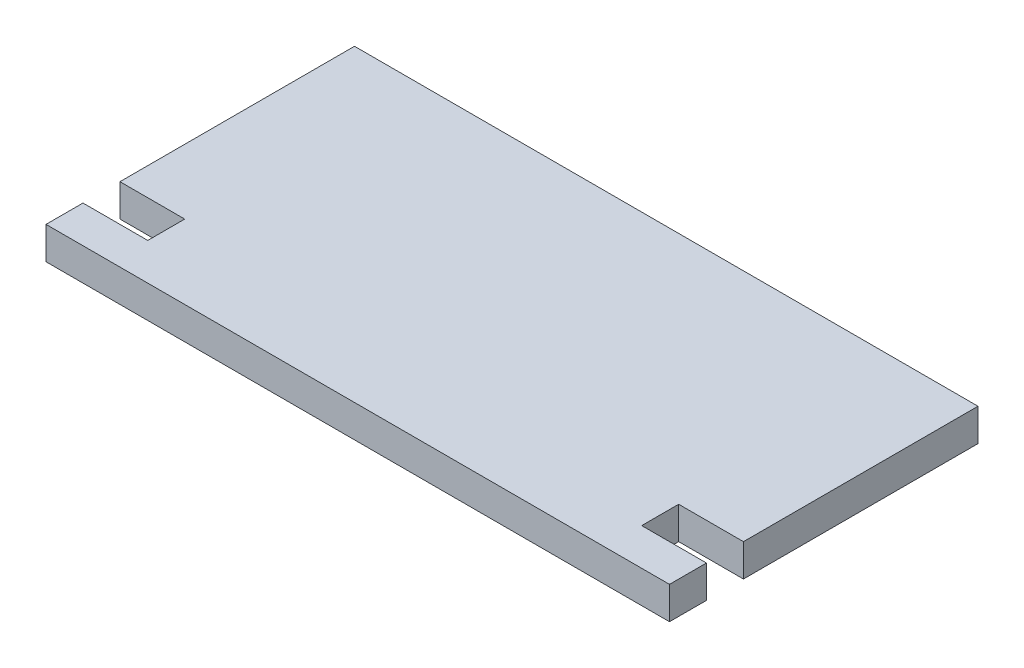
ISO-10303-21;
HEADER;
FILE_DESCRIPTION(('STEP AP214'),'2;1');
FILE_NAME('part.step','',(''),(''),'','','');
FILE_SCHEMA(('AUTOMOTIVE_DESIGN { 1 0 10303 214 1 1 1 1 }'));
ENDSEC;
DATA;
#1=APPLICATION_CONTEXT('core data for automotive mechanical design processes');
#2=APPLICATION_PROTOCOL_DEFINITION('international standard','automotive_design',2000,#1);
#3=PRODUCT_CONTEXT('',#1,'mechanical');
#4=PRODUCT('Part','Part','',(#3));
#5=PRODUCT_RELATED_PRODUCT_CATEGORY('part','',(#4));
#6=PRODUCT_DEFINITION_FORMATION('','',#4);
#7=PRODUCT_DEFINITION_CONTEXT('part definition',#1,'design');
#8=PRODUCT_DEFINITION('design','',#6,#7);
#9=PRODUCT_DEFINITION_SHAPE('','',#8);
#10=(LENGTH_UNIT() NAMED_UNIT(*) SI_UNIT(.MILLI.,.METRE.));
#11=(NAMED_UNIT(*) PLANE_ANGLE_UNIT() SI_UNIT($,.RADIAN.));
#12=(NAMED_UNIT(*) SI_UNIT($,.STERADIAN.) SOLID_ANGLE_UNIT());
#13=UNCERTAINTY_MEASURE_WITH_UNIT(LENGTH_MEASURE(1.E-05),#10,'distance_accuracy_value','');
#14=(GEOMETRIC_REPRESENTATION_CONTEXT(3) GLOBAL_UNCERTAINTY_ASSIGNED_CONTEXT((#13)) GLOBAL_UNIT_ASSIGNED_CONTEXT((#10,
#11,#12)) REPRESENTATION_CONTEXT('',''));
#15=CARTESIAN_POINT('',(0.,0.,0.));
#16=DIRECTION('',(0.,0.,1.));
#17=DIRECTION('',(1.,0.,0.));
#18=AXIS2_PLACEMENT_3D('',#15,#16,#17);
#19=CARTESIAN_POINT('',(0.,1.2,4.345));
#20=DIRECTION('',(0.,0.,-1.));
#21=DIRECTION('',(-1.,0.,0.));
#22=AXIS2_PLACEMENT_3D('',#19,#20,#21);
#23=PLANE('',#22);
#24=DIRECTION('',(1.,0.,0.));
#25=VECTOR('',#24,1.);
#26=CARTESIAN_POINT('',(0.,0.,4.345));
#27=LINE('',#26,#25);
#28=CARTESIAN_POINT('',(9.15,0.,4.345));
#29=VERTEX_POINT('',#28);
#30=CARTESIAN_POINT('',(11.55,0.,4.345));
#31=VERTEX_POINT('',#30);
#32=EDGE_CURVE('E168',#29,#31,#27,.T.);
#33=ORIENTED_EDGE('',*,*,#32,.F.);
#34=DIRECTION('',(0.,-1.,0.));
#35=VECTOR('',#34,1.);
#36=CARTESIAN_POINT('',(9.15,1.2,4.345));
#37=LINE('',#36,#35);
#38=CARTESIAN_POINT('',(9.15,1.2,4.345));
#39=VERTEX_POINT('',#38);
#40=EDGE_CURVE('E11',#39,#29,#37,.T.);
#41=ORIENTED_EDGE('',*,*,#40,.F.);
#42=DIRECTION('',(1.,0.,0.));
#43=VECTOR('',#42,1.);
#44=CARTESIAN_POINT('',(0.,1.2,4.345));
#45=LINE('',#44,#43);
#46=CARTESIAN_POINT('',(11.55,1.2,4.345));
#47=VERTEX_POINT('',#46);
#48=EDGE_CURVE('E270',#39,#47,#45,.T.);
#49=ORIENTED_EDGE('',*,*,#48,.T.);
#50=DIRECTION('',(0.,-1.,0.));
#51=VECTOR('',#50,1.);
#52=CARTESIAN_POINT('',(11.55,1.2,4.345));
#53=LINE('',#52,#51);
#54=EDGE_CURVE('E56',#47,#31,#53,.T.);
#55=ORIENTED_EDGE('',*,*,#54,.T.);
#56=EDGE_LOOP('',(#33,#41,#49,#55));
#57=FACE_BOUND('',#56,.T.);
#58=ADVANCED_FACE('F39',(#57),#23,.T.);
#59=CARTESIAN_POINT('',(9.15000000000001,1.2,0.));
#60=DIRECTION('',(-1.,0.,0.));
#61=DIRECTION('',(0.,0.,1.));
#62=AXIS2_PLACEMENT_3D('',#59,#60,#61);
#63=PLANE('',#62);
#64=DIRECTION('',(0.,0.,-1.));
#65=VECTOR('',#64,1.);
#66=CARTESIAN_POINT('',(9.15000000000001,0.,0.));
#67=LINE('',#66,#65);
#68=CARTESIAN_POINT('',(9.15,0.,2.975));
#69=VERTEX_POINT('',#68);
#70=EDGE_CURVE('E171',#29,#69,#67,.T.);
#71=ORIENTED_EDGE('',*,*,#70,.T.);
#72=DIRECTION('',(0.,-1.,0.));
#73=VECTOR('',#72,1.);
#74=CARTESIAN_POINT('',(9.15,1.2,2.975));
#75=LINE('',#74,#73);
#76=CARTESIAN_POINT('',(9.15,1.2,2.975));
#77=VERTEX_POINT('',#76);
#78=EDGE_CURVE('E48',#77,#69,#75,.T.);
#79=ORIENTED_EDGE('',*,*,#78,.F.);
#80=DIRECTION('',(0.,0.,-1.));
#81=VECTOR('',#80,1.);
#82=CARTESIAN_POINT('',(9.15000000000001,1.2,0.));
#83=LINE('',#82,#81);
#84=EDGE_CURVE('E256',#39,#77,#83,.T.);
#85=ORIENTED_EDGE('',*,*,#84,.F.);
#86=ORIENTED_EDGE('',*,*,#40,.T.);
#87=EDGE_LOOP('',(#71,#79,#85,#86));
#88=FACE_BOUND('',#87,.T.);
#89=ADVANCED_FACE('F272',(#88),#63,.F.);
#90=CARTESIAN_POINT('',(0.,1.2,2.97500000000001));
#91=DIRECTION('',(0.,0.,-1.));
#92=DIRECTION('',(-1.,0.,0.));
#93=AXIS2_PLACEMENT_3D('',#90,#91,#92);
#94=PLANE('',#93);
#95=DIRECTION('',(1.,0.,0.));
#96=VECTOR('',#95,1.);
#97=CARTESIAN_POINT('',(0.,0.,2.97500000000001));
#98=LINE('',#97,#96);
#99=CARTESIAN_POINT('',(11.55,0.,2.975));
#100=VERTEX_POINT('',#99);
#101=EDGE_CURVE('E174',#69,#100,#98,.T.);
#102=ORIENTED_EDGE('',*,*,#101,.T.);
#103=DIRECTION('',(0.,-1.,0.));
#104=VECTOR('',#103,1.);
#105=CARTESIAN_POINT('',(11.55,1.2,2.975));
#106=LINE('',#105,#104);
#107=CARTESIAN_POINT('',(11.55,1.2,2.975));
#108=VERTEX_POINT('',#107);
#109=EDGE_CURVE('E226',#108,#100,#106,.T.);
#110=ORIENTED_EDGE('',*,*,#109,.F.);
#111=DIRECTION('',(1.,0.,0.));
#112=VECTOR('',#111,1.);
#113=CARTESIAN_POINT('',(0.,1.2,2.97500000000001));
#114=LINE('',#113,#112);
#115=EDGE_CURVE('E237',#77,#108,#114,.T.);
#116=ORIENTED_EDGE('',*,*,#115,.F.);
#117=ORIENTED_EDGE('',*,*,#78,.T.);
#118=EDGE_LOOP('',(#102,#110,#116,#117));
#119=FACE_BOUND('',#118,.T.);
#120=ADVANCED_FACE('F235',(#119),#94,.F.);
#121=CARTESIAN_POINT('',(11.55,1.2,0.));
#122=DIRECTION('',(1.,0.,0.));
#123=DIRECTION('',(0.,0.,-1.));
#124=AXIS2_PLACEMENT_3D('',#121,#122,#123);
#125=PLANE('',#124);
#126=DIRECTION('',(0.,0.,1.));
#127=VECTOR('',#126,1.);
#128=CARTESIAN_POINT('',(11.55,0.,0.));
#129=LINE('',#128,#127);
#130=CARTESIAN_POINT('',(11.55,0.,-5.715));
#131=VERTEX_POINT('',#130);
#132=EDGE_CURVE('E178',#131,#100,#129,.T.);
#133=ORIENTED_EDGE('',*,*,#132,.F.);
#134=DIRECTION('',(0.,-1.,0.));
#135=VECTOR('',#134,1.);
#136=CARTESIAN_POINT('',(11.55,1.2,-5.715));
#137=LINE('',#136,#135);
#138=CARTESIAN_POINT('',(11.55,1.2,-5.715));
#139=VERTEX_POINT('',#138);
#140=EDGE_CURVE('E223',#139,#131,#137,.T.);
#141=ORIENTED_EDGE('',*,*,#140,.F.);
#142=DIRECTION('',(0.,0.,1.));
#143=VECTOR('',#142,1.);
#144=CARTESIAN_POINT('',(11.55,1.2,0.));
#145=LINE('',#144,#143);
#146=EDGE_CURVE('E164',#139,#108,#145,.T.);
#147=ORIENTED_EDGE('',*,*,#146,.T.);
#148=ORIENTED_EDGE('',*,*,#109,.T.);
#149=EDGE_LOOP('',(#133,#141,#147,#148));
#150=FACE_BOUND('',#149,.T.);
#151=ADVANCED_FACE('F246',(#150),#125,.T.);
#152=CARTESIAN_POINT('',(0.,1.2,-5.715));
#153=DIRECTION('',(0.,0.,-1.));
#154=DIRECTION('',(-1.,0.,0.));
#155=AXIS2_PLACEMENT_3D('',#152,#153,#154);
#156=PLANE('',#155);
#157=DIRECTION('',(1.,0.,0.));
#158=VECTOR('',#157,1.);
#159=CARTESIAN_POINT('',(0.,0.,-5.715));
#160=LINE('',#159,#158);
#161=CARTESIAN_POINT('',(-11.55,0.,-5.715));
#162=VERTEX_POINT('',#161);
#163=EDGE_CURVE('E182',#162,#131,#160,.T.);
#164=ORIENTED_EDGE('',*,*,#163,.F.);
#165=DIRECTION('',(0.,-1.,0.));
#166=VECTOR('',#165,1.);
#167=CARTESIAN_POINT('',(-11.55,1.2,-5.715));
#168=LINE('',#167,#166);
#169=CARTESIAN_POINT('',(-11.55,1.2,-5.715));
#170=VERTEX_POINT('',#169);
#171=EDGE_CURVE('E220',#170,#162,#168,.T.);
#172=ORIENTED_EDGE('',*,*,#171,.F.);
#173=DIRECTION('',(1.,0.,0.));
#174=VECTOR('',#173,1.);
#175=CARTESIAN_POINT('',(0.,1.2,-5.715));
#176=LINE('',#175,#174);
#177=EDGE_CURVE('E252',#170,#139,#176,.T.);
#178=ORIENTED_EDGE('',*,*,#177,.T.);
#179=ORIENTED_EDGE('',*,*,#140,.T.);
#180=EDGE_LOOP('',(#164,#172,#178,#179));
#181=FACE_BOUND('',#180,.T.);
#182=ADVANCED_FACE('F280',(#181),#156,.T.);
#183=CARTESIAN_POINT('',(-11.55,1.2,0.));
#184=DIRECTION('',(1.,0.,0.));
#185=DIRECTION('',(0.,0.,-1.));
#186=AXIS2_PLACEMENT_3D('',#183,#184,#185);
#187=PLANE('',#186);
#188=DIRECTION('',(0.,0.,1.));
#189=VECTOR('',#188,1.);
#190=CARTESIAN_POINT('',(-11.55,0.,0.));
#191=LINE('',#190,#189);
#192=CARTESIAN_POINT('',(-11.55,0.,2.97500000000001));
#193=VERTEX_POINT('',#192);
#194=EDGE_CURVE('E187',#162,#193,#191,.T.);
#195=ORIENTED_EDGE('',*,*,#194,.T.);
#196=DIRECTION('',(0.,-1.,0.));
#197=VECTOR('',#196,1.);
#198=CARTESIAN_POINT('',(-11.55,1.2,2.97500000000001));
#199=LINE('',#198,#197);
#200=CARTESIAN_POINT('',(-11.55,1.2,2.97500000000001));
#201=VERTEX_POINT('',#200);
#202=EDGE_CURVE('E217',#201,#193,#199,.T.);
#203=ORIENTED_EDGE('',*,*,#202,.F.);
#204=DIRECTION('',(0.,0.,1.));
#205=VECTOR('',#204,1.);
#206=CARTESIAN_POINT('',(-11.55,1.2,0.));
#207=LINE('',#206,#205);
#208=EDGE_CURVE('E145',#170,#201,#207,.T.);
#209=ORIENTED_EDGE('',*,*,#208,.F.);
#210=ORIENTED_EDGE('',*,*,#171,.T.);
#211=EDGE_LOOP('',(#195,#203,#209,#210));
#212=FACE_BOUND('',#211,.T.);
#213=ADVANCED_FACE('F283',(#212),#187,.F.);
#214=CARTESIAN_POINT('',(0.,1.2,2.97500000000001));
#215=DIRECTION('',(0.,0.,1.));
#216=DIRECTION('',(1.,0.,0.));
#217=AXIS2_PLACEMENT_3D('',#214,#215,#216);
#218=PLANE('',#217);
#219=DIRECTION('',(-1.,0.,0.));
#220=VECTOR('',#219,1.);
#221=CARTESIAN_POINT('',(0.,0.,2.97500000000001));
#222=LINE('',#221,#220);
#223=CARTESIAN_POINT('',(-9.15,0.,2.97500000000001));
#224=VERTEX_POINT('',#223);
#225=EDGE_CURVE('E191',#224,#193,#222,.T.);
#226=ORIENTED_EDGE('',*,*,#225,.F.);
#227=DIRECTION('',(0.,-1.,0.));
#228=VECTOR('',#227,1.);
#229=CARTESIAN_POINT('',(-9.15,1.2,2.97500000000001));
#230=LINE('',#229,#228);
#231=CARTESIAN_POINT('',(-9.15,1.2,2.97500000000001));
#232=VERTEX_POINT('',#231);
#233=EDGE_CURVE('E214',#232,#224,#230,.T.);
#234=ORIENTED_EDGE('',*,*,#233,.F.);
#235=DIRECTION('',(-1.,0.,0.));
#236=VECTOR('',#235,1.);
#237=CARTESIAN_POINT('',(0.,1.2,2.97500000000001));
#238=LINE('',#237,#236);
#239=EDGE_CURVE('E261',#232,#201,#238,.T.);
#240=ORIENTED_EDGE('',*,*,#239,.T.);
#241=ORIENTED_EDGE('',*,*,#202,.T.);
#242=EDGE_LOOP('',(#226,#234,#240,#241));
#243=FACE_BOUND('',#242,.T.);
#244=ADVANCED_FACE('F285',(#243),#218,.T.);
#245=CARTESIAN_POINT('',(-9.15,1.2,0.));
#246=DIRECTION('',(-1.,0.,0.));
#247=DIRECTION('',(0.,0.,1.));
#248=AXIS2_PLACEMENT_3D('',#245,#246,#247);
#249=PLANE('',#248);
#250=DIRECTION('',(0.,0.,-1.));
#251=VECTOR('',#250,1.);
#252=CARTESIAN_POINT('',(-9.15,0.,0.));
#253=LINE('',#252,#251);
#254=CARTESIAN_POINT('',(-9.15,0.,4.34500000000001));
#255=VERTEX_POINT('',#254);
#256=EDGE_CURVE('E195',#255,#224,#253,.T.);
#257=ORIENTED_EDGE('',*,*,#256,.F.);
#258=DIRECTION('',(0.,-1.,0.));
#259=VECTOR('',#258,1.);
#260=CARTESIAN_POINT('',(-9.15,1.2,4.34500000000001));
#261=LINE('',#260,#259);
#262=CARTESIAN_POINT('',(-9.15,1.2,4.34500000000001));
#263=VERTEX_POINT('',#262);
#264=EDGE_CURVE('E211',#263,#255,#261,.T.);
#265=ORIENTED_EDGE('',*,*,#264,.F.);
#266=DIRECTION('',(0.,0.,-1.));
#267=VECTOR('',#266,1.);
#268=CARTESIAN_POINT('',(-9.15,1.2,0.));
#269=LINE('',#268,#267);
#270=EDGE_CURVE('E263',#263,#232,#269,.T.);
#271=ORIENTED_EDGE('',*,*,#270,.T.);
#272=ORIENTED_EDGE('',*,*,#233,.T.);
#273=EDGE_LOOP('',(#257,#265,#271,#272));
#274=FACE_BOUND('',#273,.T.);
#275=ADVANCED_FACE('F288',(#274),#249,.T.);
#276=CARTESIAN_POINT('',(0.,1.2,4.34500000000001));
#277=DIRECTION('',(0.,0.,1.));
#278=DIRECTION('',(1.,0.,0.));
#279=AXIS2_PLACEMENT_3D('',#276,#277,#278);
#280=PLANE('',#279);
#281=DIRECTION('',(-1.,0.,0.));
#282=VECTOR('',#281,1.);
#283=CARTESIAN_POINT('',(0.,0.,4.34500000000001));
#284=LINE('',#283,#282);
#285=CARTESIAN_POINT('',(-11.55,0.,4.34500000000001));
#286=VERTEX_POINT('',#285);
#287=EDGE_CURVE('E199',#255,#286,#284,.T.);
#288=ORIENTED_EDGE('',*,*,#287,.T.);
#289=DIRECTION('',(0.,-1.,0.));
#290=VECTOR('',#289,1.);
#291=CARTESIAN_POINT('',(-11.55,1.2,4.34500000000001));
#292=LINE('',#291,#290);
#293=CARTESIAN_POINT('',(-11.55,1.2,4.34500000000001));
#294=VERTEX_POINT('',#293);
#295=EDGE_CURVE('E154',#294,#286,#292,.T.);
#296=ORIENTED_EDGE('',*,*,#295,.F.);
#297=DIRECTION('',(-1.,0.,0.));
#298=VECTOR('',#297,1.);
#299=CARTESIAN_POINT('',(0.,1.2,4.34500000000001));
#300=LINE('',#299,#298);
#301=EDGE_CURVE('E139',#263,#294,#300,.T.);
#302=ORIENTED_EDGE('',*,*,#301,.F.);
#303=ORIENTED_EDGE('',*,*,#264,.T.);
#304=EDGE_LOOP('',(#288,#296,#302,#303));
#305=FACE_BOUND('',#304,.T.);
#306=ADVANCED_FACE('F292',(#305),#280,.F.);
#307=CARTESIAN_POINT('',(-11.55,0.,5.71500000000001));
#308=VERTEX_POINT('',#307);
#309=EDGE_CURVE('E150',#286,#308,#191,.T.);
#310=ORIENTED_EDGE('',*,*,#309,.T.);
#311=DIRECTION('',(0.,-1.,0.));
#312=VECTOR('',#311,1.);
#313=CARTESIAN_POINT('',(-11.55,1.2,5.71500000000001));
#314=LINE('',#313,#312);
#315=CARTESIAN_POINT('',(-11.55,1.2,5.71500000000001));
#316=VERTEX_POINT('',#315);
#317=EDGE_CURVE('E147',#316,#308,#314,.T.);
#318=ORIENTED_EDGE('',*,*,#317,.F.);
#319=EDGE_CURVE('E130',#294,#316,#207,.T.);
#320=ORIENTED_EDGE('',*,*,#319,.F.);
#321=ORIENTED_EDGE('',*,*,#295,.T.);
#322=EDGE_LOOP('',(#310,#318,#320,#321));
#323=FACE_BOUND('',#322,.T.);
#324=ADVANCED_FACE('F148',(#323),#187,.F.);
#325=CARTESIAN_POINT('',(0.,1.2,5.715));
#326=DIRECTION('',(0.,0.,-1.));
#327=DIRECTION('',(-1.,0.,0.));
#328=AXIS2_PLACEMENT_3D('',#325,#326,#327);
#329=PLANE('',#328);
#330=DIRECTION('',(1.,0.,0.));
#331=VECTOR('',#330,1.);
#332=CARTESIAN_POINT('',(0.,0.,5.715));
#333=LINE('',#332,#331);
#334=CARTESIAN_POINT('',(11.55,0.,5.715));
#335=VERTEX_POINT('',#334);
#336=EDGE_CURVE('E202',#308,#335,#333,.T.);
#337=ORIENTED_EDGE('',*,*,#336,.T.);
#338=DIRECTION('',(0.,-1.,0.));
#339=VECTOR('',#338,1.);
#340=CARTESIAN_POINT('',(11.55,1.2,5.715));
#341=LINE('',#340,#339);
#342=CARTESIAN_POINT('',(11.55,1.2,5.715));
#343=VERTEX_POINT('',#342);
#344=EDGE_CURVE('E94',#343,#335,#341,.T.);
#345=ORIENTED_EDGE('',*,*,#344,.F.);
#346=DIRECTION('',(1.,0.,0.));
#347=VECTOR('',#346,1.);
#348=CARTESIAN_POINT('',(0.,1.2,5.715));
#349=LINE('',#348,#347);
#350=EDGE_CURVE('E136',#316,#343,#349,.T.);
#351=ORIENTED_EDGE('',*,*,#350,.F.);
#352=ORIENTED_EDGE('',*,*,#317,.T.);
#353=EDGE_LOOP('',(#337,#345,#351,#352));
#354=FACE_BOUND('',#353,.T.);
#355=ADVANCED_FACE('F156',(#354),#329,.F.);
#356=EDGE_CURVE('E183',#31,#335,#129,.T.);
#357=ORIENTED_EDGE('',*,*,#356,.F.);
#358=ORIENTED_EDGE('',*,*,#54,.F.);
#359=EDGE_CURVE('E158',#47,#343,#145,.T.);
#360=ORIENTED_EDGE('',*,*,#359,.T.);
#361=ORIENTED_EDGE('',*,*,#344,.T.);
#362=EDGE_LOOP('',(#357,#358,#360,#361));
#363=FACE_BOUND('',#362,.T.);
#364=ADVANCED_FACE('F300',(#363),#125,.T.);
#365=CARTESIAN_POINT('',(0.,1.2,0.));
#366=DIRECTION('',(0.,1.,0.));
#367=DIRECTION('',(0.,0.,1.));
#368=AXIS2_PLACEMENT_3D('',#365,#366,#367);
#369=PLANE('',#368);
#370=ORIENTED_EDGE('',*,*,#48,.F.);
#371=ORIENTED_EDGE('',*,*,#84,.T.);
#372=ORIENTED_EDGE('',*,*,#115,.T.);
#373=ORIENTED_EDGE('',*,*,#146,.F.);
#374=ORIENTED_EDGE('',*,*,#177,.F.);
#375=ORIENTED_EDGE('',*,*,#208,.T.);
#376=ORIENTED_EDGE('',*,*,#239,.F.);
#377=ORIENTED_EDGE('',*,*,#270,.F.);
#378=ORIENTED_EDGE('',*,*,#301,.T.);
#379=ORIENTED_EDGE('',*,*,#319,.T.);
#380=ORIENTED_EDGE('',*,*,#350,.T.);
#381=ORIENTED_EDGE('',*,*,#359,.F.);
#382=EDGE_LOOP('',(#370,#371,#372,#373,#374,#375,#376,#377,#378,#379,#380,#381));
#383=FACE_BOUND('',#382,.T.);
#384=ADVANCED_FACE('F133',(#383),#369,.T.);
#385=CARTESIAN_POINT('',(0.,0.,0.));
#386=DIRECTION('',(0.,1.,0.));
#387=DIRECTION('',(0.,0.,1.));
#388=AXIS2_PLACEMENT_3D('',#385,#386,#387);
#389=PLANE('',#388);
#390=ORIENTED_EDGE('',*,*,#32,.T.);
#391=ORIENTED_EDGE('',*,*,#356,.T.);
#392=ORIENTED_EDGE('',*,*,#336,.F.);
#393=ORIENTED_EDGE('',*,*,#309,.F.);
#394=ORIENTED_EDGE('',*,*,#287,.F.);
#395=ORIENTED_EDGE('',*,*,#256,.T.);
#396=ORIENTED_EDGE('',*,*,#225,.T.);
#397=ORIENTED_EDGE('',*,*,#194,.F.);
#398=ORIENTED_EDGE('',*,*,#163,.T.);
#399=ORIENTED_EDGE('',*,*,#132,.T.);
#400=ORIENTED_EDGE('',*,*,#101,.F.);
#401=ORIENTED_EDGE('',*,*,#70,.F.);
#402=EDGE_LOOP('',(#390,#391,#392,#393,#394,#395,#396,#397,#398,#399,#400,#401));
#403=FACE_BOUND('',#402,.T.);
#404=ADVANCED_FACE('F241',(#403),#389,.F.);
#405=CLOSED_SHELL('',(#58,#89,#120,#151,#182,#213,#244,#275,#306,#324,#355,#364,#384,#404));
#406=MANIFOLD_SOLID_BREP('B2',#405);
#407=ADVANCED_BREP_SHAPE_REPRESENTATION('',(#18,#406),#14);
#408=SHAPE_DEFINITION_REPRESENTATION(#9,#407);
ENDSEC;
END-ISO-10303-21;
